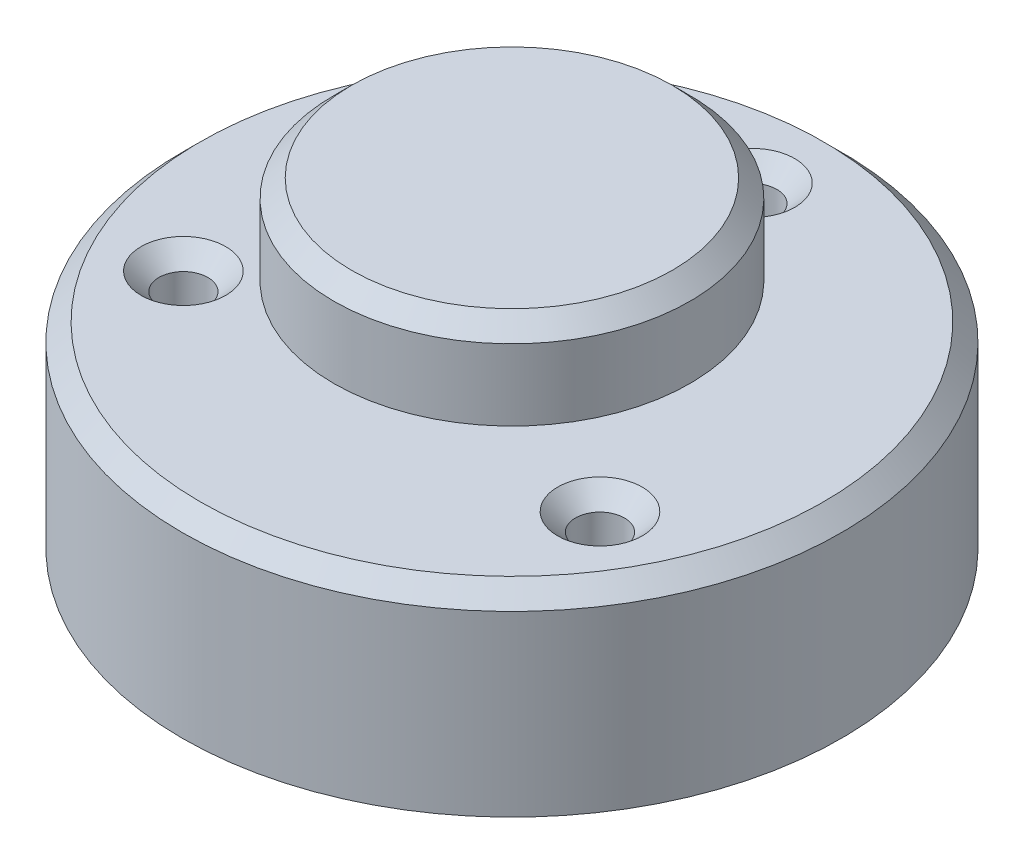
ISO-10303-21;
HEADER;
FILE_DESCRIPTION(('STEP AP214'),'2;1');
FILE_NAME('part.step','',(''),(''),'','','');
FILE_SCHEMA(('AUTOMOTIVE_DESIGN { 1 0 10303 214 1 1 1 1 }'));
ENDSEC;
DATA;
#1=APPLICATION_CONTEXT('core data for automotive mechanical design processes');
#2=APPLICATION_PROTOCOL_DEFINITION('international standard','automotive_design',2000,#1);
#3=PRODUCT_CONTEXT('',#1,'mechanical');
#4=PRODUCT('Part','Part','',(#3));
#5=PRODUCT_RELATED_PRODUCT_CATEGORY('part','',(#4));
#6=PRODUCT_DEFINITION_FORMATION('','',#4);
#7=PRODUCT_DEFINITION_CONTEXT('part definition',#1,'design');
#8=PRODUCT_DEFINITION('design','',#6,#7);
#9=PRODUCT_DEFINITION_SHAPE('','',#8);
#10=(LENGTH_UNIT() NAMED_UNIT(*) SI_UNIT(.MILLI.,.METRE.));
#11=(NAMED_UNIT(*) PLANE_ANGLE_UNIT() SI_UNIT($,.RADIAN.));
#12=(NAMED_UNIT(*) SI_UNIT($,.STERADIAN.) SOLID_ANGLE_UNIT());
#13=UNCERTAINTY_MEASURE_WITH_UNIT(LENGTH_MEASURE(1.E-05),#10,'distance_accuracy_value','');
#14=(GEOMETRIC_REPRESENTATION_CONTEXT(3) GLOBAL_UNCERTAINTY_ASSIGNED_CONTEXT((#13)) GLOBAL_UNIT_ASSIGNED_CONTEXT((#10,
#11,#12)) REPRESENTATION_CONTEXT('',''));
#15=CARTESIAN_POINT('',(0.,0.,0.));
#16=DIRECTION('',(0.,0.,1.));
#17=DIRECTION('',(1.,0.,0.));
#18=AXIS2_PLACEMENT_3D('',#15,#16,#17);
#19=CARTESIAN_POINT('',(0.,11.,0.));
#20=DIRECTION('',(0.,1.,0.));
#21=DIRECTION('',(0.,0.,1.));
#22=AXIS2_PLACEMENT_3D('',#19,#20,#21);
#23=PLANE('',#22);
#24=CARTESIAN_POINT('',(0.,11.,0.));
#25=DIRECTION('',(0.,1.,0.));
#26=DIRECTION('',(0.,0.,1.));
#27=AXIS2_PLACEMENT_3D('',#24,#25,#26);
#28=CIRCLE('',#27,17.5);
#29=CARTESIAN_POINT('',(0.,11.,17.5));
#30=VERTEX_POINT('',#29);
#31=EDGE_CURVE('E66',#30,#30,#28,.T.);
#32=ORIENTED_EDGE('',*,*,#31,.T.);
#33=EDGE_LOOP('',(#32));
#34=FACE_BOUND('',#33,.T.);
#35=CARTESIAN_POINT('',(11.6913429510899,11.,6.75000000000004));
#36=DIRECTION('',(0.,1.,0.));
#37=DIRECTION('',(0.,0.,1.));
#38=AXIS2_PLACEMENT_3D('',#35,#36,#37);
#39=CIRCLE('',#38,2.375);
#40=CARTESIAN_POINT('',(11.6913429510899,11.,9.12500000000004));
#41=VERTEX_POINT('',#40);
#42=EDGE_CURVE('E80',#41,#41,#39,.F.);
#43=ORIENTED_EDGE('',*,*,#42,.T.);
#44=EDGE_LOOP('',(#43));
#45=FACE_BOUND('',#44,.T.);
#46=CARTESIAN_POINT('',(-11.6913429510899,11.,6.74999999999997));
#47=DIRECTION('',(0.,1.,0.));
#48=DIRECTION('',(0.,0.,1.));
#49=AXIS2_PLACEMENT_3D('',#46,#47,#48);
#50=CIRCLE('',#49,2.37499999999999);
#51=CARTESIAN_POINT('',(-11.6913429510899,11.,9.12499999999997));
#52=VERTEX_POINT('',#51);
#53=EDGE_CURVE('E84',#52,#52,#50,.F.);
#54=ORIENTED_EDGE('',*,*,#53,.T.);
#55=EDGE_LOOP('',(#54));
#56=FACE_BOUND('',#55,.T.);
#57=CARTESIAN_POINT('',(0.,11.,-13.5));
#58=DIRECTION('',(0.,1.,0.));
#59=DIRECTION('',(0.,0.,1.));
#60=AXIS2_PLACEMENT_3D('',#57,#58,#59);
#61=CIRCLE('',#60,2.375);
#62=CARTESIAN_POINT('',(0.,11.,-11.125));
#63=VERTEX_POINT('',#62);
#64=EDGE_CURVE('E88',#63,#63,#61,.F.);
#65=ORIENTED_EDGE('',*,*,#64,.T.);
#66=EDGE_LOOP('',(#65));
#67=FACE_BOUND('',#66,.T.);
#68=CARTESIAN_POINT('',(0.,11.,0.));
#69=DIRECTION('',(0.,1.,0.));
#70=DIRECTION('',(0.,0.,1.));
#71=AXIS2_PLACEMENT_3D('',#68,#69,#70);
#72=CIRCLE('',#71,6.);
#73=CARTESIAN_POINT('',(0.,11.,6.));
#74=VERTEX_POINT('',#73);
#75=EDGE_CURVE('E96',#74,#74,#72,.F.);
#76=ORIENTED_EDGE('',*,*,#75,.T.);
#77=EDGE_LOOP('',(#76));
#78=FACE_BOUND('',#77,.T.);
#79=ADVANCED_FACE('F47',(#34,#45,#56,#67,#78),#23,.T.);
#80=CARTESIAN_POINT('',(0.,0.,0.));
#81=DIRECTION('',(0.,1.,0.));
#82=DIRECTION('',(0.,0.,1.));
#83=AXIS2_PLACEMENT_3D('',#80,#81,#82);
#84=PLANE('',#83);
#85=CARTESIAN_POINT('',(0.,0.,0.));
#86=DIRECTION('',(0.,1.,0.));
#87=DIRECTION('',(0.,0.,1.));
#88=AXIS2_PLACEMENT_3D('',#85,#86,#87);
#89=CIRCLE('',#88,18.5);
#90=CARTESIAN_POINT('',(0.,0.,18.5));
#91=VERTEX_POINT('',#90);
#92=EDGE_CURVE('E109',#91,#91,#89,.T.);
#93=ORIENTED_EDGE('',*,*,#92,.F.);
#94=EDGE_LOOP('',(#93));
#95=FACE_BOUND('',#94,.T.);
#96=CARTESIAN_POINT('',(0.,0.,-13.5));
#97=DIRECTION('',(0.,1.,0.));
#98=DIRECTION('',(0.,0.,1.));
#99=AXIS2_PLACEMENT_3D('',#96,#97,#98);
#100=CIRCLE('',#99,1.375);
#101=CARTESIAN_POINT('',(0.,0.,-12.125));
#102=VERTEX_POINT('',#101);
#103=EDGE_CURVE('E113',#102,#102,#100,.T.);
#104=ORIENTED_EDGE('',*,*,#103,.T.);
#105=EDGE_LOOP('',(#104));
#106=FACE_BOUND('',#105,.T.);
#107=CARTESIAN_POINT('',(-11.6913429510899,0.,6.74999999999997));
#108=DIRECTION('',(0.,1.,0.));
#109=DIRECTION('',(0.,0.,1.));
#110=AXIS2_PLACEMENT_3D('',#107,#108,#109);
#111=CIRCLE('',#110,1.375);
#112=CARTESIAN_POINT('',(-11.6913429510899,0.,8.12499999999997));
#113=VERTEX_POINT('',#112);
#114=EDGE_CURVE('E117',#113,#113,#111,.T.);
#115=ORIENTED_EDGE('',*,*,#114,.T.);
#116=EDGE_LOOP('',(#115));
#117=FACE_BOUND('',#116,.T.);
#118=CARTESIAN_POINT('',(11.6913429510899,0.,6.75000000000004));
#119=DIRECTION('',(0.,1.,0.));
#120=DIRECTION('',(0.,0.,1.));
#121=AXIS2_PLACEMENT_3D('',#118,#119,#120);
#122=CIRCLE('',#121,1.375);
#123=CARTESIAN_POINT('',(11.6913429510899,0.,8.12500000000004));
#124=VERTEX_POINT('',#123);
#125=EDGE_CURVE('E121',#124,#124,#122,.T.);
#126=ORIENTED_EDGE('',*,*,#125,.T.);
#127=EDGE_LOOP('',(#126));
#128=FACE_BOUND('',#127,.T.);
#129=ADVANCED_FACE('F148',(#95,#106,#117,#128),#84,.F.);
#130=CARTESIAN_POINT('',(0.,11.,0.));
#131=DIRECTION('',(0.,-1.,0.));
#132=DIRECTION('',(0.,0.,-1.));
#133=AXIS2_PLACEMENT_3D('',#130,#131,#132);
#134=CYLINDRICAL_SURFACE('',#133,18.5);
#135=CARTESIAN_POINT('',(0.,9.99999999999999,0.));
#136=DIRECTION('',(0.,1.,0.));
#137=DIRECTION('',(0.,0.,1.));
#138=AXIS2_PLACEMENT_3D('',#135,#136,#137);
#139=CIRCLE('',#138,18.5);
#140=CARTESIAN_POINT('',(0.,9.99999999999999,18.5));
#141=VERTEX_POINT('',#140);
#142=EDGE_CURVE('E61',#141,#141,#139,.F.);
#143=ORIENTED_EDGE('',*,*,#142,.T.);
#144=EDGE_LOOP('',(#143));
#145=FACE_BOUND('',#144,.T.);
#146=ORIENTED_EDGE('',*,*,#92,.T.);
#147=EDGE_LOOP('',(#146));
#148=FACE_BOUND('',#147,.T.);
#149=ADVANCED_FACE('F155',(#145,#148),#134,.T.);
#150=CARTESIAN_POINT('',(0.,11.,-13.5));
#151=DIRECTION('',(0.,-1.,0.));
#152=DIRECTION('',(0.,0.,-1.));
#153=AXIS2_PLACEMENT_3D('',#150,#151,#152);
#154=CYLINDRICAL_SURFACE('',#153,1.375);
#155=CARTESIAN_POINT('',(0.,10.,-13.5));
#156=DIRECTION('',(0.,1.,0.));
#157=DIRECTION('',(0.,0.,1.));
#158=AXIS2_PLACEMENT_3D('',#155,#156,#157);
#159=CIRCLE('',#158,1.375);
#160=CARTESIAN_POINT('',(0.,10.,-12.125));
#161=VERTEX_POINT('',#160);
#162=EDGE_CURVE('E72',#161,#161,#159,.T.);
#163=ORIENTED_EDGE('',*,*,#162,.T.);
#164=EDGE_LOOP('',(#163));
#165=FACE_BOUND('',#164,.T.);
#166=ORIENTED_EDGE('',*,*,#103,.F.);
#167=EDGE_LOOP('',(#166));
#168=FACE_BOUND('',#167,.T.);
#169=ADVANCED_FACE('F160',(#165,#168),#154,.F.);
#170=CARTESIAN_POINT('',(-11.6913429510899,11.,6.74999999999997));
#171=DIRECTION('',(0.,-1.,0.));
#172=DIRECTION('',(0.,0.,-1.));
#173=AXIS2_PLACEMENT_3D('',#170,#171,#172);
#174=CYLINDRICAL_SURFACE('',#173,1.375);
#175=CARTESIAN_POINT('',(-11.6913429510899,10.,6.74999999999997));
#176=DIRECTION('',(0.,1.,0.));
#177=DIRECTION('',(0.,0.,1.));
#178=AXIS2_PLACEMENT_3D('',#175,#176,#177);
#179=CIRCLE('',#178,1.375);
#180=CARTESIAN_POINT('',(-11.6913429510899,10.,8.12499999999997));
#181=VERTEX_POINT('',#180);
#182=EDGE_CURVE('E76',#181,#181,#179,.T.);
#183=ORIENTED_EDGE('',*,*,#182,.T.);
#184=EDGE_LOOP('',(#183));
#185=FACE_BOUND('',#184,.T.);
#186=ORIENTED_EDGE('',*,*,#114,.F.);
#187=EDGE_LOOP('',(#186));
#188=FACE_BOUND('',#187,.T.);
#189=ADVANCED_FACE('F211',(#185,#188),#174,.F.);
#190=CARTESIAN_POINT('',(11.6913429510899,11.,6.75000000000004));
#191=DIRECTION('',(0.,-1.,0.));
#192=DIRECTION('',(0.,0.,-1.));
#193=AXIS2_PLACEMENT_3D('',#190,#191,#192);
#194=CYLINDRICAL_SURFACE('',#193,1.375);
#195=CARTESIAN_POINT('',(11.6913429510899,10.,6.75000000000004));
#196=DIRECTION('',(0.,1.,0.));
#197=DIRECTION('',(0.,0.,1.));
#198=AXIS2_PLACEMENT_3D('',#195,#196,#197);
#199=CIRCLE('',#198,1.375);
#200=CARTESIAN_POINT('',(11.6913429510899,10.,8.12500000000004));
#201=VERTEX_POINT('',#200);
#202=EDGE_CURVE('E92',#201,#201,#199,.T.);
#203=ORIENTED_EDGE('',*,*,#202,.T.);
#204=EDGE_LOOP('',(#203));
#205=FACE_BOUND('',#204,.T.);
#206=ORIENTED_EDGE('',*,*,#125,.F.);
#207=EDGE_LOOP('',(#206));
#208=FACE_BOUND('',#207,.T.);
#209=ADVANCED_FACE('F209',(#205,#208),#194,.F.);
#210=CARTESIAN_POINT('',(0.,18.,0.));
#211=DIRECTION('',(0.,-1.,0.));
#212=DIRECTION('',(0.,0.,-1.));
#213=AXIS2_PLACEMENT_3D('',#210,#211,#212);
#214=CYLINDRICAL_SURFACE('',#213,10.);
#215=CARTESIAN_POINT('',(0.,17.,0.));
#216=DIRECTION('',(0.,1.,0.));
#217=DIRECTION('',(0.,0.,1.));
#218=AXIS2_PLACEMENT_3D('',#215,#216,#217);
#219=CIRCLE('',#218,10.);
#220=CARTESIAN_POINT('',(0.,17.,10.));
#221=VERTEX_POINT('',#220);
#222=EDGE_CURVE('E10',#221,#221,#219,.F.);
#223=ORIENTED_EDGE('',*,*,#222,.T.);
#224=EDGE_LOOP('',(#223));
#225=FACE_BOUND('',#224,.T.);
#226=CARTESIAN_POINT('',(0.,13.,0.));
#227=DIRECTION('',(0.,1.,0.));
#228=DIRECTION('',(0.,0.,1.));
#229=AXIS2_PLACEMENT_3D('',#226,#227,#228);
#230=CIRCLE('',#229,10.);
#231=CARTESIAN_POINT('',(0.,13.,10.));
#232=VERTEX_POINT('',#231);
#233=EDGE_CURVE('E101',#232,#232,#230,.T.);
#234=ORIENTED_EDGE('',*,*,#233,.T.);
#235=EDGE_LOOP('',(#234));
#236=FACE_BOUND('',#235,.T.);
#237=ADVANCED_FACE('F129',(#225,#236),#214,.T.);
#238=CARTESIAN_POINT('',(0.,18.,0.));
#239=DIRECTION('',(0.,1.,0.));
#240=DIRECTION('',(0.,0.,1.));
#241=AXIS2_PLACEMENT_3D('',#238,#239,#240);
#242=PLANE('',#241);
#243=CARTESIAN_POINT('',(0.,18.,0.));
#244=DIRECTION('',(0.,1.,0.));
#245=DIRECTION('',(0.,0.,1.));
#246=AXIS2_PLACEMENT_3D('',#243,#244,#245);
#247=CIRCLE('',#246,8.99999999999999);
#248=CARTESIAN_POINT('',(0.,18.,8.99999999999999));
#249=VERTEX_POINT('',#248);
#250=EDGE_CURVE('E56',#249,#249,#247,.T.);
#251=ORIENTED_EDGE('',*,*,#250,.T.);
#252=EDGE_LOOP('',(#251));
#253=FACE_BOUND('',#252,.T.);
#254=ADVANCED_FACE('F134',(#253),#242,.T.);
#255=CARTESIAN_POINT('',(0.,13.,0.));
#256=DIRECTION('',(0.,1.,0.));
#257=DIRECTION('',(0.,0.,1.));
#258=AXIS2_PLACEMENT_3D('',#255,#256,#257);
#259=PLANE('',#258);
#260=CARTESIAN_POINT('',(0.,13.,0.));
#261=DIRECTION('',(0.,1.,0.));
#262=DIRECTION('',(0.,0.,1.));
#263=AXIS2_PLACEMENT_3D('',#260,#261,#262);
#264=CIRCLE('',#263,6.);
#265=CARTESIAN_POINT('',(0.,13.,6.));
#266=VERTEX_POINT('',#265);
#267=EDGE_CURVE('E105',#266,#266,#264,.T.);
#268=ORIENTED_EDGE('',*,*,#267,.T.);
#269=EDGE_LOOP('',(#268));
#270=FACE_BOUND('',#269,.T.);
#271=ORIENTED_EDGE('',*,*,#233,.F.);
#272=EDGE_LOOP('',(#271));
#273=FACE_BOUND('',#272,.T.);
#274=ADVANCED_FACE('F131',(#270,#273),#259,.F.);
#275=CARTESIAN_POINT('',(0.,12.,0.));
#276=DIRECTION('',(0.,1.,0.));
#277=DIRECTION('',(0.,0.,1.));
#278=AXIS2_PLACEMENT_3D('',#275,#276,#277);
#279=TOROIDAL_SURFACE('',#278,6.,1.);
#280=ORIENTED_EDGE('',*,*,#75,.F.);
#281=EDGE_LOOP('',(#280));
#282=FACE_BOUND('',#281,.T.);
#283=CARTESIAN_POINT('',(0.,12.,0.));
#284=DIRECTION('',(0.,1.,0.));
#285=DIRECTION('',(0.,0.,1.));
#286=AXIS2_PLACEMENT_3D('',#283,#284,#285);
#287=CIRCLE('',#286,5.);
#288=CARTESIAN_POINT('',(0.,12.,5.));
#289=VERTEX_POINT('',#288);
#290=EDGE_CURVE('E97',#289,#289,#287,.T.);
#291=ORIENTED_EDGE('',*,*,#290,.F.);
#292=EDGE_LOOP('',(#291));
#293=FACE_BOUND('',#292,.T.);
#294=ADVANCED_FACE('F133',(#282,#293),#279,.F.);
#295=CARTESIAN_POINT('',(0.,12.,0.));
#296=DIRECTION('',(0.,1.,0.));
#297=DIRECTION('',(0.,0.,1.));
#298=AXIS2_PLACEMENT_3D('',#295,#296,#297);
#299=TOROIDAL_SURFACE('',#298,6.,1.);
#300=ORIENTED_EDGE('',*,*,#290,.T.);
#301=EDGE_LOOP('',(#300));
#302=FACE_BOUND('',#301,.T.);
#303=ORIENTED_EDGE('',*,*,#267,.F.);
#304=EDGE_LOOP('',(#303));
#305=FACE_BOUND('',#304,.T.);
#306=ADVANCED_FACE('F141',(#302,#305),#299,.F.);
#307=CARTESIAN_POINT('',(11.6913429510899,10.,6.75000000000004));
#308=DIRECTION('',(0.,1.,0.));
#309=DIRECTION('',(0.,0.,1.));
#310=AXIS2_PLACEMENT_3D('',#307,#308,#309);
#311=CONICAL_SURFACE('',#310,1.375,0.785398163397453);
#312=ORIENTED_EDGE('',*,*,#42,.F.);
#313=EDGE_LOOP('',(#312));
#314=FACE_BOUND('',#313,.T.);
#315=ORIENTED_EDGE('',*,*,#202,.F.);
#316=EDGE_LOOP('',(#315));
#317=FACE_BOUND('',#316,.T.);
#318=ADVANCED_FACE('F166',(#314,#317),#311,.F.);
#319=CARTESIAN_POINT('',(-11.6913429510899,10.,6.74999999999997));
#320=DIRECTION('',(0.,1.,0.));
#321=DIRECTION('',(0.,0.,1.));
#322=AXIS2_PLACEMENT_3D('',#319,#320,#321);
#323=CONICAL_SURFACE('',#322,1.375,0.785398163397452);
#324=ORIENTED_EDGE('',*,*,#53,.F.);
#325=EDGE_LOOP('',(#324));
#326=FACE_BOUND('',#325,.T.);
#327=ORIENTED_EDGE('',*,*,#182,.F.);
#328=EDGE_LOOP('',(#327));
#329=FACE_BOUND('',#328,.T.);
#330=ADVANCED_FACE('F175',(#326,#329),#323,.F.);
#331=CARTESIAN_POINT('',(0.,10.,-13.5));
#332=DIRECTION('',(0.,1.,0.));
#333=DIRECTION('',(0.,0.,1.));
#334=AXIS2_PLACEMENT_3D('',#331,#332,#333);
#335=CONICAL_SURFACE('',#334,1.375,0.785398163397453);
#336=ORIENTED_EDGE('',*,*,#64,.F.);
#337=EDGE_LOOP('',(#336));
#338=FACE_BOUND('',#337,.T.);
#339=ORIENTED_EDGE('',*,*,#162,.F.);
#340=EDGE_LOOP('',(#339));
#341=FACE_BOUND('',#340,.T.);
#342=ADVANCED_FACE('F182',(#338,#341),#335,.F.);
#343=CARTESIAN_POINT('',(0.,11.,0.));
#344=DIRECTION('',(0.,-1.,0.));
#345=DIRECTION('',(0.,0.,-1.));
#346=AXIS2_PLACEMENT_3D('',#343,#344,#345);
#347=CONICAL_SURFACE('',#346,17.5,0.785398163397447);
#348=ORIENTED_EDGE('',*,*,#142,.F.);
#349=EDGE_LOOP('',(#348));
#350=FACE_BOUND('',#349,.T.);
#351=ORIENTED_EDGE('',*,*,#31,.F.);
#352=EDGE_LOOP('',(#351));
#353=FACE_BOUND('',#352,.T.);
#354=ADVANCED_FACE('F187',(#350,#353),#347,.T.);
#355=CARTESIAN_POINT('',(0.,18.,0.));
#356=DIRECTION('',(0.,-1.,0.));
#357=DIRECTION('',(0.,0.,-1.));
#358=AXIS2_PLACEMENT_3D('',#355,#356,#357);
#359=CONICAL_SURFACE('',#358,8.99999999999999,0.785398163397446);
#360=ORIENTED_EDGE('',*,*,#222,.F.);
#361=EDGE_LOOP('',(#360));
#362=FACE_BOUND('',#361,.T.);
#363=ORIENTED_EDGE('',*,*,#250,.F.);
#364=EDGE_LOOP('',(#363));
#365=FACE_BOUND('',#364,.T.);
#366=ADVANCED_FACE('F50',(#362,#365),#359,.T.);
#367=CLOSED_SHELL('',(#79,#129,#149,#169,#189,#209,#237,#254,#274,#294,#306,#318,#330,#342,#354,#366));
#368=MANIFOLD_SOLID_BREP('B2',#367);
#369=ADVANCED_BREP_SHAPE_REPRESENTATION('',(#18,#368),#14);
#370=SHAPE_DEFINITION_REPRESENTATION(#9,#369);
ENDSEC;
END-ISO-10303-21;
